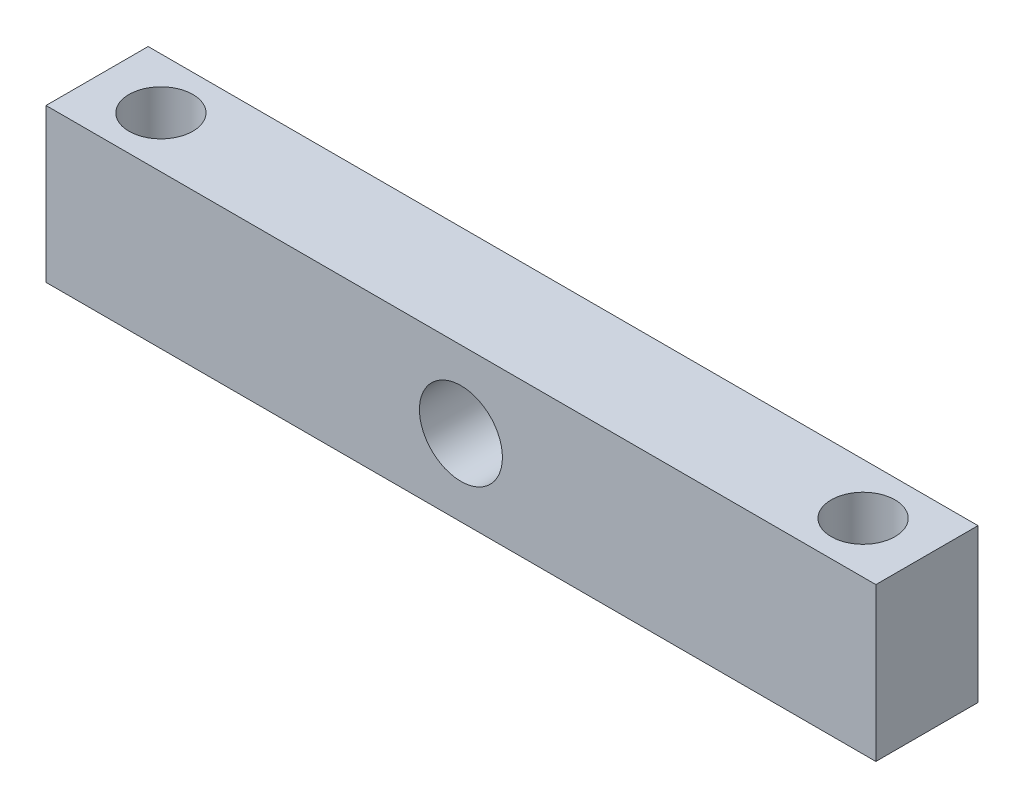
ISO-10303-21;
HEADER;
FILE_DESCRIPTION(('STEP AP214'),'2;1');
FILE_NAME('part.step','',(''),(''),'','','');
FILE_SCHEMA(('AUTOMOTIVE_DESIGN { 1 0 10303 214 1 1 1 1 }'));
ENDSEC;
DATA;
#1=APPLICATION_CONTEXT('core data for automotive mechanical design processes');
#2=APPLICATION_PROTOCOL_DEFINITION('international standard','automotive_design',2000,#1);
#3=PRODUCT_CONTEXT('',#1,'mechanical');
#4=PRODUCT('Part','Part','',(#3));
#5=PRODUCT_RELATED_PRODUCT_CATEGORY('part','',(#4));
#6=PRODUCT_DEFINITION_FORMATION('','',#4);
#7=PRODUCT_DEFINITION_CONTEXT('part definition',#1,'design');
#8=PRODUCT_DEFINITION('design','',#6,#7);
#9=PRODUCT_DEFINITION_SHAPE('','',#8);
#10=(LENGTH_UNIT() NAMED_UNIT(*) SI_UNIT(.MILLI.,.METRE.));
#11=(NAMED_UNIT(*) PLANE_ANGLE_UNIT() SI_UNIT($,.RADIAN.));
#12=(NAMED_UNIT(*) SI_UNIT($,.STERADIAN.) SOLID_ANGLE_UNIT());
#13=UNCERTAINTY_MEASURE_WITH_UNIT(LENGTH_MEASURE(1.E-05),#10,'distance_accuracy_value','');
#14=(GEOMETRIC_REPRESENTATION_CONTEXT(3) GLOBAL_UNCERTAINTY_ASSIGNED_CONTEXT((#13)) GLOBAL_UNIT_ASSIGNED_CONTEXT((#10,
#11,#12)) REPRESENTATION_CONTEXT('',''));
#15=CARTESIAN_POINT('',(0.,0.,0.));
#16=DIRECTION('',(0.,0.,1.));
#17=DIRECTION('',(1.,0.,0.));
#18=AXIS2_PLACEMENT_3D('',#15,#16,#17);
#19=CARTESIAN_POINT('',(0.,12.,0.));
#20=DIRECTION('',(0.,-1.,0.));
#21=DIRECTION('',(0.,0.,-1.));
#22=AXIS2_PLACEMENT_3D('',#19,#20,#21);
#23=PLANE('',#22);
#24=DIRECTION('',(0.,0.,-1.));
#25=VECTOR('',#24,1.);
#26=CARTESIAN_POINT('',(32.5,12.,4.));
#27=LINE('',#26,#25);
#28=CARTESIAN_POINT('',(32.5,12.,4.));
#29=VERTEX_POINT('',#28);
#30=CARTESIAN_POINT('',(32.5,12.,-4.));
#31=VERTEX_POINT('',#30);
#32=EDGE_CURVE('E93',#29,#31,#27,.T.);
#33=ORIENTED_EDGE('',*,*,#32,.T.);
#34=DIRECTION('',(-1.,0.,0.));
#35=VECTOR('',#34,1.);
#36=CARTESIAN_POINT('',(-32.5,12.,-4.));
#37=LINE('',#36,#35);
#38=CARTESIAN_POINT('',(-32.5,12.,-4.));
#39=VERTEX_POINT('',#38);
#40=EDGE_CURVE('E88',#31,#39,#37,.T.);
#41=ORIENTED_EDGE('',*,*,#40,.T.);
#42=DIRECTION('',(0.,0.,1.));
#43=VECTOR('',#42,1.);
#44=CARTESIAN_POINT('',(-32.5,12.,4.));
#45=LINE('',#44,#43);
#46=CARTESIAN_POINT('',(-32.5,12.,4.));
#47=VERTEX_POINT('',#46);
#48=EDGE_CURVE('E91',#39,#47,#45,.T.);
#49=ORIENTED_EDGE('',*,*,#48,.T.);
#50=DIRECTION('',(1.,0.,0.));
#51=VECTOR('',#50,1.);
#52=CARTESIAN_POINT('',(-32.5,12.,4.));
#53=LINE('',#52,#51);
#54=EDGE_CURVE('E58',#47,#29,#53,.T.);
#55=ORIENTED_EDGE('',*,*,#54,.T.);
#56=EDGE_LOOP('',(#33,#41,#49,#55));
#57=FACE_BOUND('',#56,.T.);
#58=CARTESIAN_POINT('',(-27.5,12.,0.));
#59=DIRECTION('',(0.,1.,0.));
#60=DIRECTION('',(0.,0.,1.));
#61=AXIS2_PLACEMENT_3D('',#58,#59,#60);
#62=CIRCLE('',#61,2.5);
#63=CARTESIAN_POINT('',(-27.5,12.,2.5));
#64=VERTEX_POINT('',#63);
#65=EDGE_CURVE('E108',#64,#64,#62,.T.);
#66=ORIENTED_EDGE('',*,*,#65,.F.);
#67=EDGE_LOOP('',(#66));
#68=FACE_BOUND('',#67,.T.);
#69=CARTESIAN_POINT('',(27.5,12.,0.));
#70=DIRECTION('',(0.,1.,0.));
#71=DIRECTION('',(0.,0.,1.));
#72=AXIS2_PLACEMENT_3D('',#69,#70,#71);
#73=CIRCLE('',#72,2.5);
#74=CARTESIAN_POINT('',(27.5,12.,2.49999999999999));
#75=VERTEX_POINT('',#74);
#76=EDGE_CURVE('E123',#75,#75,#73,.T.);
#77=ORIENTED_EDGE('',*,*,#76,.F.);
#78=EDGE_LOOP('',(#77));
#79=FACE_BOUND('',#78,.T.);
#80=ADVANCED_FACE('F41',(#57,#68,#79),#23,.F.);
#81=CARTESIAN_POINT('',(0.,0.,0.));
#82=DIRECTION('',(0.,-1.,0.));
#83=DIRECTION('',(0.,0.,-1.));
#84=AXIS2_PLACEMENT_3D('',#81,#82,#83);
#85=PLANE('',#84);
#86=CARTESIAN_POINT('',(-27.5,0.,0.));
#87=DIRECTION('',(0.,1.,0.));
#88=DIRECTION('',(0.,0.,1.));
#89=AXIS2_PLACEMENT_3D('',#86,#87,#88);
#90=CIRCLE('',#89,2.5);
#91=CARTESIAN_POINT('',(-27.5,0.,2.5));
#92=VERTEX_POINT('',#91);
#93=EDGE_CURVE('E120',#92,#92,#90,.T.);
#94=ORIENTED_EDGE('',*,*,#93,.T.);
#95=EDGE_LOOP('',(#94));
#96=FACE_BOUND('',#95,.T.);
#97=DIRECTION('',(0.,0.,-1.));
#98=VECTOR('',#97,1.);
#99=CARTESIAN_POINT('',(32.5,0.,4.));
#100=LINE('',#99,#98);
#101=CARTESIAN_POINT('',(32.5,0.,4.));
#102=VERTEX_POINT('',#101);
#103=CARTESIAN_POINT('',(32.5,0.,-4.));
#104=VERTEX_POINT('',#103);
#105=EDGE_CURVE('E105',#102,#104,#100,.T.);
#106=ORIENTED_EDGE('',*,*,#105,.F.);
#107=DIRECTION('',(1.,0.,0.));
#108=VECTOR('',#107,1.);
#109=CARTESIAN_POINT('',(-32.5,0.,4.));
#110=LINE('',#109,#108);
#111=CARTESIAN_POINT('',(-32.5,0.,4.));
#112=VERTEX_POINT('',#111);
#113=EDGE_CURVE('E81',#112,#102,#110,.T.);
#114=ORIENTED_EDGE('',*,*,#113,.F.);
#115=DIRECTION('',(0.,0.,1.));
#116=VECTOR('',#115,1.);
#117=CARTESIAN_POINT('',(-32.5,0.,4.));
#118=LINE('',#117,#116);
#119=CARTESIAN_POINT('',(-32.5,0.,-4.));
#120=VERTEX_POINT('',#119);
#121=EDGE_CURVE('E75',#120,#112,#118,.T.);
#122=ORIENTED_EDGE('',*,*,#121,.F.);
#123=DIRECTION('',(-1.,0.,0.));
#124=VECTOR('',#123,1.);
#125=CARTESIAN_POINT('',(-32.5,0.,-4.));
#126=LINE('',#125,#124);
#127=EDGE_CURVE('E97',#104,#120,#126,.T.);
#128=ORIENTED_EDGE('',*,*,#127,.F.);
#129=EDGE_LOOP('',(#106,#114,#122,#128));
#130=FACE_BOUND('',#129,.T.);
#131=CARTESIAN_POINT('',(27.5,0.,0.));
#132=DIRECTION('',(0.,1.,0.));
#133=DIRECTION('',(0.,0.,1.));
#134=AXIS2_PLACEMENT_3D('',#131,#132,#133);
#135=CIRCLE('',#134,2.5);
#136=CARTESIAN_POINT('',(27.5,0.,2.49999999999999));
#137=VERTEX_POINT('',#136);
#138=EDGE_CURVE('E126',#137,#137,#135,.T.);
#139=ORIENTED_EDGE('',*,*,#138,.T.);
#140=EDGE_LOOP('',(#139));
#141=FACE_BOUND('',#140,.T.);
#142=ADVANCED_FACE('F116',(#96,#130,#141),#85,.T.);
#143=CARTESIAN_POINT('',(32.5,12.,4.));
#144=DIRECTION('',(-1.,0.,0.));
#145=DIRECTION('',(0.,0.,1.));
#146=AXIS2_PLACEMENT_3D('',#143,#144,#145);
#147=PLANE('',#146);
#148=ORIENTED_EDGE('',*,*,#105,.T.);
#149=DIRECTION('',(0.,-1.,0.));
#150=VECTOR('',#149,1.);
#151=CARTESIAN_POINT('',(32.5,12.,-4.));
#152=LINE('',#151,#150);
#153=EDGE_CURVE('E11',#31,#104,#152,.T.);
#154=ORIENTED_EDGE('',*,*,#153,.F.);
#155=ORIENTED_EDGE('',*,*,#32,.F.);
#156=DIRECTION('',(0.,-1.,0.));
#157=VECTOR('',#156,1.);
#158=CARTESIAN_POINT('',(32.5,12.,4.));
#159=LINE('',#158,#157);
#160=EDGE_CURVE('E101',#29,#102,#159,.T.);
#161=ORIENTED_EDGE('',*,*,#160,.T.);
#162=EDGE_LOOP('',(#148,#154,#155,#161));
#163=FACE_BOUND('',#162,.T.);
#164=ADVANCED_FACE('F43',(#163),#147,.F.);
#165=CARTESIAN_POINT('',(-32.5,12.,-4.));
#166=DIRECTION('',(0.,0.,1.));
#167=DIRECTION('',(1.,0.,0.));
#168=AXIS2_PLACEMENT_3D('',#165,#166,#167);
#169=PLANE('',#168);
#170=CARTESIAN_POINT('',(0.,6.00000000000003,-4.));
#171=DIRECTION('',(0.,0.,1.));
#172=DIRECTION('',(1.,0.,0.));
#173=AXIS2_PLACEMENT_3D('',#170,#171,#172);
#174=CIRCLE('',#173,3.25);
#175=CARTESIAN_POINT('',(3.25,6.00000000000003,-4.));
#176=VERTEX_POINT('',#175);
#177=EDGE_CURVE('E129',#176,#176,#174,.T.);
#178=ORIENTED_EDGE('',*,*,#177,.T.);
#179=EDGE_LOOP('',(#178));
#180=FACE_BOUND('',#179,.T.);
#181=ORIENTED_EDGE('',*,*,#127,.T.);
#182=DIRECTION('',(0.,-1.,0.));
#183=VECTOR('',#182,1.);
#184=CARTESIAN_POINT('',(-32.5,12.,-4.));
#185=LINE('',#184,#183);
#186=EDGE_CURVE('E50',#39,#120,#185,.T.);
#187=ORIENTED_EDGE('',*,*,#186,.F.);
#188=ORIENTED_EDGE('',*,*,#40,.F.);
#189=ORIENTED_EDGE('',*,*,#153,.T.);
#190=EDGE_LOOP('',(#181,#187,#188,#189));
#191=FACE_BOUND('',#190,.T.);
#192=ADVANCED_FACE('F96',(#180,#191),#169,.F.);
#193=CARTESIAN_POINT('',(-32.5,12.,4.));
#194=DIRECTION('',(1.,0.,0.));
#195=DIRECTION('',(0.,0.,-1.));
#196=AXIS2_PLACEMENT_3D('',#193,#194,#195);
#197=PLANE('',#196);
#198=ORIENTED_EDGE('',*,*,#121,.T.);
#199=DIRECTION('',(0.,-1.,0.));
#200=VECTOR('',#199,1.);
#201=CARTESIAN_POINT('',(-32.5,12.,4.));
#202=LINE('',#201,#200);
#203=EDGE_CURVE('E98',#47,#112,#202,.T.);
#204=ORIENTED_EDGE('',*,*,#203,.F.);
#205=ORIENTED_EDGE('',*,*,#48,.F.);
#206=ORIENTED_EDGE('',*,*,#186,.T.);
#207=EDGE_LOOP('',(#198,#204,#205,#206));
#208=FACE_BOUND('',#207,.T.);
#209=ADVANCED_FACE('F99',(#208),#197,.F.);
#210=CARTESIAN_POINT('',(-32.5,12.,4.));
#211=DIRECTION('',(0.,0.,-1.));
#212=DIRECTION('',(-1.,0.,0.));
#213=AXIS2_PLACEMENT_3D('',#210,#211,#212);
#214=PLANE('',#213);
#215=CARTESIAN_POINT('',(0.,6.00000000000003,4.));
#216=DIRECTION('',(0.,0.,1.));
#217=DIRECTION('',(1.,0.,0.));
#218=AXIS2_PLACEMENT_3D('',#215,#216,#217);
#219=CIRCLE('',#218,3.25);
#220=CARTESIAN_POINT('',(3.25,6.00000000000003,4.));
#221=VERTEX_POINT('',#220);
#222=EDGE_CURVE('E132',#221,#221,#219,.T.);
#223=ORIENTED_EDGE('',*,*,#222,.F.);
#224=EDGE_LOOP('',(#223));
#225=FACE_BOUND('',#224,.T.);
#226=ORIENTED_EDGE('',*,*,#113,.T.);
#227=ORIENTED_EDGE('',*,*,#160,.F.);
#228=ORIENTED_EDGE('',*,*,#54,.F.);
#229=ORIENTED_EDGE('',*,*,#203,.T.);
#230=EDGE_LOOP('',(#226,#227,#228,#229));
#231=FACE_BOUND('',#230,.T.);
#232=ADVANCED_FACE('F113',(#225,#231),#214,.F.);
#233=CARTESIAN_POINT('',(-27.5,12.,0.));
#234=DIRECTION('',(0.,-1.,0.));
#235=DIRECTION('',(0.,0.,-1.));
#236=AXIS2_PLACEMENT_3D('',#233,#234,#235);
#237=CYLINDRICAL_SURFACE('',#236,2.5);
#238=ORIENTED_EDGE('',*,*,#65,.T.);
#239=EDGE_LOOP('',(#238));
#240=FACE_BOUND('',#239,.T.);
#241=ORIENTED_EDGE('',*,*,#93,.F.);
#242=EDGE_LOOP('',(#241));
#243=FACE_BOUND('',#242,.T.);
#244=ADVANCED_FACE('F147',(#240,#243),#237,.F.);
#245=CARTESIAN_POINT('',(27.5,12.,0.));
#246=DIRECTION('',(0.,-1.,0.));
#247=DIRECTION('',(0.,0.,-1.));
#248=AXIS2_PLACEMENT_3D('',#245,#246,#247);
#249=CYLINDRICAL_SURFACE('',#248,2.5);
#250=ORIENTED_EDGE('',*,*,#76,.T.);
#251=EDGE_LOOP('',(#250));
#252=FACE_BOUND('',#251,.T.);
#253=ORIENTED_EDGE('',*,*,#138,.F.);
#254=EDGE_LOOP('',(#253));
#255=FACE_BOUND('',#254,.T.);
#256=ADVANCED_FACE('F142',(#252,#255),#249,.F.);
#257=CARTESIAN_POINT('',(0.,6.00000000000003,-4.));
#258=DIRECTION('',(0.,0.,1.));
#259=DIRECTION('',(1.,0.,0.));
#260=AXIS2_PLACEMENT_3D('',#257,#258,#259);
#261=CYLINDRICAL_SURFACE('',#260,3.25);
#262=ORIENTED_EDGE('',*,*,#177,.F.);
#263=EDGE_LOOP('',(#262));
#264=FACE_BOUND('',#263,.T.);
#265=ORIENTED_EDGE('',*,*,#222,.T.);
#266=EDGE_LOOP('',(#265));
#267=FACE_BOUND('',#266,.T.);
#268=ADVANCED_FACE('F139',(#264,#267),#261,.F.);
#269=CLOSED_SHELL('',(#80,#142,#164,#192,#209,#232,#244,#256,#268));
#270=MANIFOLD_SOLID_BREP('B2',#269);
#271=ADVANCED_BREP_SHAPE_REPRESENTATION('',(#18,#270),#14);
#272=SHAPE_DEFINITION_REPRESENTATION(#9,#271);
ENDSEC;
END-ISO-10303-21;
